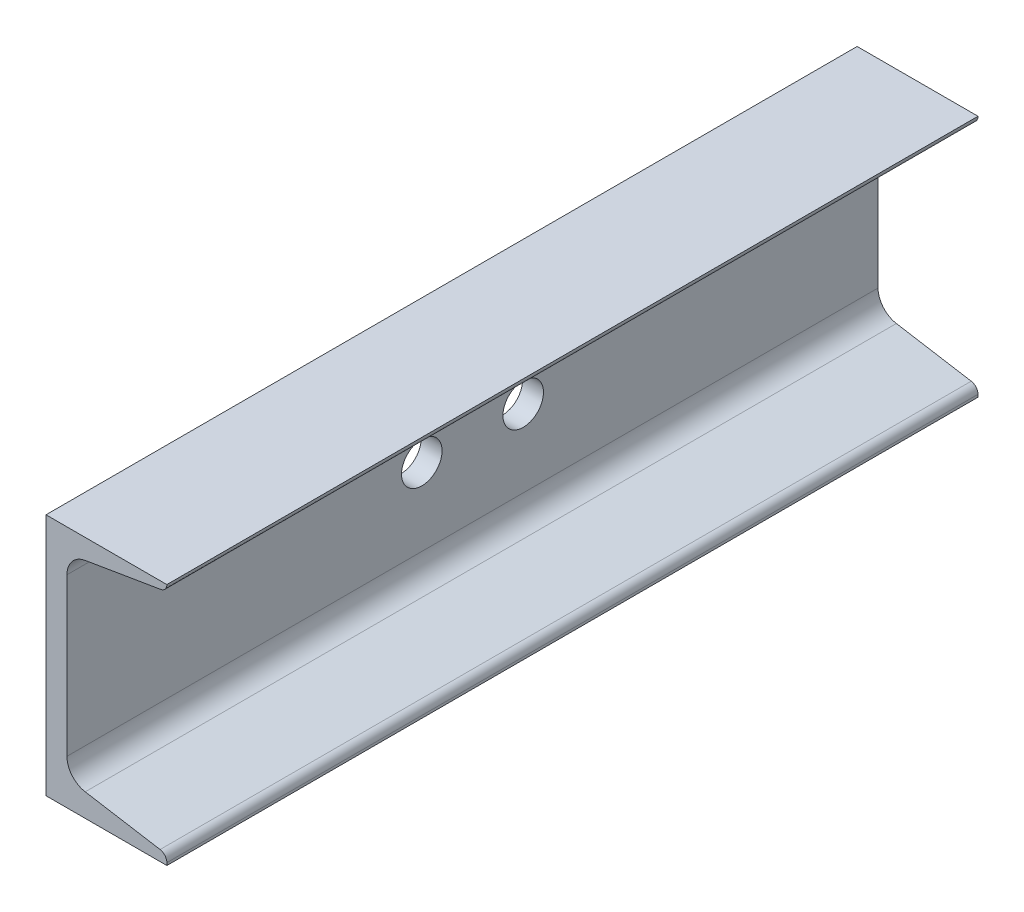
ISO-10303-21;
HEADER;
FILE_DESCRIPTION(('STEP AP214'),'2;1');
FILE_NAME('part.step','',(''),(''),'','','');
FILE_SCHEMA(('AUTOMOTIVE_DESIGN { 1 0 10303 214 1 1 1 1 }'));
ENDSEC;
DATA;
#1=APPLICATION_CONTEXT('core data for automotive mechanical design processes');
#2=APPLICATION_PROTOCOL_DEFINITION('international standard','automotive_design',2000,#1);
#3=PRODUCT_CONTEXT('',#1,'mechanical');
#4=PRODUCT('Part','Part','',(#3));
#5=PRODUCT_RELATED_PRODUCT_CATEGORY('part','',(#4));
#6=PRODUCT_DEFINITION_FORMATION('','',#4);
#7=PRODUCT_DEFINITION_CONTEXT('part definition',#1,'design');
#8=PRODUCT_DEFINITION('design','',#6,#7);
#9=PRODUCT_DEFINITION_SHAPE('','',#8);
#10=(LENGTH_UNIT() NAMED_UNIT(*) SI_UNIT(.MILLI.,.METRE.));
#11=(NAMED_UNIT(*) PLANE_ANGLE_UNIT() SI_UNIT($,.RADIAN.));
#12=(NAMED_UNIT(*) SI_UNIT($,.STERADIAN.) SOLID_ANGLE_UNIT());
#13=UNCERTAINTY_MEASURE_WITH_UNIT(LENGTH_MEASURE(1.E-05),#10,'distance_accuracy_value','');
#14=(GEOMETRIC_REPRESENTATION_CONTEXT(3) GLOBAL_UNCERTAINTY_ASSIGNED_CONTEXT((#13)) GLOBAL_UNIT_ASSIGNED_CONTEXT((#10,
#11,#12)) REPRESENTATION_CONTEXT('',''));
#15=CARTESIAN_POINT('',(0.,0.,0.));
#16=DIRECTION('',(0.,0.,1.));
#17=DIRECTION('',(1.,0.,0.));
#18=AXIS2_PLACEMENT_3D('',#15,#16,#17);
#19=CARTESIAN_POINT('',(37.846,-38.1,127.));
#20=DIRECTION('',(-1.,0.,0.));
#21=DIRECTION('',(0.,0.,1.));
#22=AXIS2_PLACEMENT_3D('',#19,#20,#21);
#23=PLANE('',#22);
#24=DIRECTION('',(0.,1.,0.));
#25=VECTOR('',#24,1.);
#26=CARTESIAN_POINT('',(37.846,-38.1,-127.));
#27=LINE('',#26,#25);
#28=CARTESIAN_POINT('',(37.846,-38.1,-127.));
#29=VERTEX_POINT('',#28);
#30=CARTESIAN_POINT('',(37.846,-37.3185419041306,-127.));
#31=VERTEX_POINT('',#30);
#32=EDGE_CURVE('E152',#29,#31,#27,.T.);
#33=ORIENTED_EDGE('',*,*,#32,.T.);
#34=DIRECTION('',(0.,0.,-1.));
#35=VECTOR('',#34,1.);
#36=CARTESIAN_POINT('',(37.846,-37.3185419041306,127.));
#37=LINE('',#36,#35);
#38=CARTESIAN_POINT('',(37.846,-37.3185419041306,127.));
#39=VERTEX_POINT('',#38);
#40=EDGE_CURVE('E11',#39,#31,#37,.T.);
#41=ORIENTED_EDGE('',*,*,#40,.F.);
#42=DIRECTION('',(0.,1.,0.));
#43=VECTOR('',#42,1.);
#44=CARTESIAN_POINT('',(37.846,-38.1,127.));
#45=LINE('',#44,#43);
#46=CARTESIAN_POINT('',(37.846,-38.1,127.));
#47=VERTEX_POINT('',#46);
#48=EDGE_CURVE('E176',#47,#39,#45,.T.);
#49=ORIENTED_EDGE('',*,*,#48,.F.);
#50=DIRECTION('',(0.,0.,-1.));
#51=VECTOR('',#50,1.);
#52=CARTESIAN_POINT('',(37.846,-38.1,127.));
#53=LINE('',#52,#51);
#54=EDGE_CURVE('E148',#47,#29,#53,.T.);
#55=ORIENTED_EDGE('',*,*,#54,.T.);
#56=EDGE_LOOP('',(#33,#41,#49,#55));
#57=FACE_BOUND('',#56,.T.);
#58=ADVANCED_FACE('F32',(#57),#23,.F.);
#59=CARTESIAN_POINT('',(35.306,-37.3185419041306,127.));
#60=DIRECTION('',(0.,0.,-1.));
#61=DIRECTION('',(-1.,0.,0.));
#62=AXIS2_PLACEMENT_3D('',#59,#60,#61);
#63=CYLINDRICAL_SURFACE('',#62,2.54);
#64=CARTESIAN_POINT('',(35.306,-37.3185419041306,-127.));
#65=DIRECTION('',(0.,0.,1.));
#66=DIRECTION('',(-1.,0.,0.));
#67=AXIS2_PLACEMENT_3D('',#64,#65,#66);
#68=CIRCLE('',#67,2.54);
#69=CARTESIAN_POINT('',(35.7252209188861,-34.813376476226,-127.));
#70=VERTEX_POINT('',#69);
#71=EDGE_CURVE('E155',#31,#70,#68,.T.);
#72=ORIENTED_EDGE('',*,*,#71,.T.);
#73=DIRECTION('',(0.,0.,-1.));
#74=VECTOR('',#73,1.);
#75=CARTESIAN_POINT('',(35.7252209188861,-34.813376476226,127.));
#76=LINE('',#75,#74);
#77=CARTESIAN_POINT('',(35.7252209188861,-34.813376476226,127.));
#78=VERTEX_POINT('',#77);
#79=EDGE_CURVE('E40',#78,#70,#76,.T.);
#80=ORIENTED_EDGE('',*,*,#79,.F.);
#81=CARTESIAN_POINT('',(35.306,-37.3185419041306,127.));
#82=DIRECTION('',(0.,0.,1.));
#83=DIRECTION('',(-1.,0.,0.));
#84=AXIS2_PLACEMENT_3D('',#81,#82,#83);
#85=CIRCLE('',#84,2.54);
#86=EDGE_CURVE('E103',#39,#78,#85,.T.);
#87=ORIENTED_EDGE('',*,*,#86,.F.);
#88=ORIENTED_EDGE('',*,*,#40,.T.);
#89=EDGE_LOOP('',(#72,#80,#87,#88));
#90=FACE_BOUND('',#89,.T.);
#91=ADVANCED_FACE('F254',(#90),#63,.T.);
#92=CARTESIAN_POINT('',(12.2793035190076,-30.889875486223,127.));
#93=DIRECTION('',(-0.165047605860671,-0.986285601537232,0.));
#94=DIRECTION('',(0.986285601537233,-0.165047605860671,0.));
#95=AXIS2_PLACEMENT_3D('',#92,#93,#94);
#96=PLANE('',#95);
#97=DIRECTION('',(-0.986285601537232,0.165047605860671,0.));
#98=VECTOR('',#97,1.);
#99=CARTESIAN_POINT('',(12.2793035190076,-30.889875486223,-127.));
#100=LINE('',#99,#98);
#101=CARTESIAN_POINT('',(12.2793035190076,-30.889875486223,-127.));
#102=VERTEX_POINT('',#101);
#103=EDGE_CURVE('E158',#70,#102,#100,.T.);
#104=ORIENTED_EDGE('',*,*,#103,.T.);
#105=DIRECTION('',(0.,0.,-1.));
#106=VECTOR('',#105,1.);
#107=CARTESIAN_POINT('',(12.2793035190076,-30.889875486223,127.));
#108=LINE('',#107,#106);
#109=CARTESIAN_POINT('',(12.2793035190076,-30.889875486223,127.));
#110=VERTEX_POINT('',#109);
#111=EDGE_CURVE('E195',#110,#102,#108,.T.);
#112=ORIENTED_EDGE('',*,*,#111,.F.);
#113=DIRECTION('',(-0.986285601537232,0.165047605860671,0.));
#114=VECTOR('',#113,1.);
#115=CARTESIAN_POINT('',(12.2793035190076,-30.889875486223,127.));
#116=LINE('',#115,#114);
#117=EDGE_CURVE('E203',#78,#110,#116,.T.);
#118=ORIENTED_EDGE('',*,*,#117,.F.);
#119=ORIENTED_EDGE('',*,*,#79,.T.);
#120=EDGE_LOOP('',(#104,#112,#118,#119));
#121=FACE_BOUND('',#120,.T.);
#122=ADVANCED_FACE('F201',(#121),#96,.F.);
#123=CARTESIAN_POINT('',(13.4112,-24.1259288308807,127.));
#124=DIRECTION('',(0.,0.,-1.));
#125=DIRECTION('',(-1.,0.,0.));
#126=AXIS2_PLACEMENT_3D('',#123,#124,#125);
#127=CYLINDRICAL_SURFACE('',#126,6.858);
#128=CARTESIAN_POINT('',(13.4112,-24.1259288308807,-127.));
#129=DIRECTION('',(0.,0.,-1.));
#130=DIRECTION('',(1.,0.,0.));
#131=AXIS2_PLACEMENT_3D('',#128,#129,#130);
#132=CIRCLE('',#131,6.858);
#133=CARTESIAN_POINT('',(6.55320000000001,-24.1259288308806,-127.));
#134=VERTEX_POINT('',#133);
#135=EDGE_CURVE('E160',#102,#134,#132,.T.);
#136=ORIENTED_EDGE('',*,*,#135,.T.);
#137=DIRECTION('',(0.,0.,-1.));
#138=VECTOR('',#137,1.);
#139=CARTESIAN_POINT('',(6.55320000000001,-24.1259288308806,127.));
#140=LINE('',#139,#138);
#141=CARTESIAN_POINT('',(6.55320000000001,-24.1259288308806,127.));
#142=VERTEX_POINT('',#141);
#143=EDGE_CURVE('E192',#142,#134,#140,.T.);
#144=ORIENTED_EDGE('',*,*,#143,.F.);
#145=CARTESIAN_POINT('',(13.4112,-24.1259288308807,127.));
#146=DIRECTION('',(0.,0.,-1.));
#147=DIRECTION('',(1.,0.,0.));
#148=AXIS2_PLACEMENT_3D('',#145,#146,#147);
#149=CIRCLE('',#148,6.858);
#150=EDGE_CURVE('E221',#110,#142,#149,.T.);
#151=ORIENTED_EDGE('',*,*,#150,.F.);
#152=ORIENTED_EDGE('',*,*,#111,.T.);
#153=EDGE_LOOP('',(#136,#144,#151,#152));
#154=FACE_BOUND('',#153,.T.);
#155=ADVANCED_FACE('F212',(#154),#127,.F.);
#156=CARTESIAN_POINT('',(6.5532,25.1016128592281,127.));
#157=DIRECTION('',(-1.,0.,0.));
#158=DIRECTION('',(0.,-1.,0.));
#159=AXIS2_PLACEMENT_3D('',#156,#157,#158);
#160=PLANE('',#159);
#161=CARTESIAN_POINT('',(6.5532,0.,15.875));
#162=DIRECTION('',(-1.,0.,0.));
#163=DIRECTION('',(0.,-1.,0.));
#164=AXIS2_PLACEMENT_3D('',#161,#162,#163);
#165=CIRCLE('',#164,6.35);
#166=CARTESIAN_POINT('',(6.5532,-6.35,15.875));
#167=VERTEX_POINT('',#166);
#168=EDGE_CURVE('E339',#167,#167,#165,.F.);
#169=ORIENTED_EDGE('',*,*,#168,.F.);
#170=EDGE_LOOP('',(#169));
#171=FACE_BOUND('',#170,.T.);
#172=CARTESIAN_POINT('',(6.5532,0.,-15.875));
#173=DIRECTION('',(-1.,0.,0.));
#174=DIRECTION('',(0.,-1.,0.));
#175=AXIS2_PLACEMENT_3D('',#172,#173,#174);
#176=CIRCLE('',#175,6.35);
#177=CARTESIAN_POINT('',(6.5532,-6.35,-15.875));
#178=VERTEX_POINT('',#177);
#179=EDGE_CURVE('E156',#178,#178,#176,.F.);
#180=ORIENTED_EDGE('',*,*,#179,.F.);
#181=EDGE_LOOP('',(#180));
#182=FACE_BOUND('',#181,.T.);
#183=DIRECTION('',(0.,1.,0.));
#184=VECTOR('',#183,1.);
#185=CARTESIAN_POINT('',(6.5532,25.1016128592281,-127.));
#186=LINE('',#185,#184);
#187=CARTESIAN_POINT('',(6.5532,25.1016128592281,-127.));
#188=VERTEX_POINT('',#187);
#189=EDGE_CURVE('E162',#134,#188,#186,.T.);
#190=ORIENTED_EDGE('',*,*,#189,.T.);
#191=DIRECTION('',(0.,0.,-1.));
#192=VECTOR('',#191,1.);
#193=CARTESIAN_POINT('',(6.5532,25.1016128592281,127.));
#194=LINE('',#193,#192);
#195=CARTESIAN_POINT('',(6.5532,25.1016128592281,127.));
#196=VERTEX_POINT('',#195);
#197=EDGE_CURVE('E189',#196,#188,#194,.T.);
#198=ORIENTED_EDGE('',*,*,#197,.F.);
#199=DIRECTION('',(0.,1.,0.));
#200=VECTOR('',#199,1.);
#201=CARTESIAN_POINT('',(6.5532,25.1016128592281,127.));
#202=LINE('',#201,#200);
#203=EDGE_CURVE('E218',#142,#196,#202,.T.);
#204=ORIENTED_EDGE('',*,*,#203,.F.);
#205=ORIENTED_EDGE('',*,*,#143,.T.);
#206=EDGE_LOOP('',(#190,#198,#204,#205));
#207=FACE_BOUND('',#206,.T.);
#208=ADVANCED_FACE('F216',(#171,#182,#207),#160,.F.);
#209=CARTESIAN_POINT('',(13.4112,25.1016128592282,127.));
#210=DIRECTION('',(0.,0.,-1.));
#211=DIRECTION('',(-1.,0.,0.));
#212=AXIS2_PLACEMENT_3D('',#209,#210,#211);
#213=CYLINDRICAL_SURFACE('',#212,6.858);
#214=CARTESIAN_POINT('',(13.4112,25.1016128592282,-127.));
#215=DIRECTION('',(0.,0.,-1.));
#216=DIRECTION('',(1.,0.,0.));
#217=AXIS2_PLACEMENT_3D('',#214,#215,#216);
#218=CIRCLE('',#217,6.858);
#219=CARTESIAN_POINT('',(12.2793035190075,31.8655595145705,-127.));
#220=VERTEX_POINT('',#219);
#221=EDGE_CURVE('E164',#188,#220,#218,.T.);
#222=ORIENTED_EDGE('',*,*,#221,.T.);
#223=DIRECTION('',(0.,0.,-1.));
#224=VECTOR('',#223,1.);
#225=CARTESIAN_POINT('',(12.2793035190075,31.8655595145705,127.));
#226=LINE('',#225,#224);
#227=CARTESIAN_POINT('',(12.2793035190075,31.8655595145705,127.));
#228=VERTEX_POINT('',#227);
#229=EDGE_CURVE('E186',#228,#220,#226,.T.);
#230=ORIENTED_EDGE('',*,*,#229,.F.);
#231=CARTESIAN_POINT('',(13.4112,25.1016128592282,127.));
#232=DIRECTION('',(0.,0.,-1.));
#233=DIRECTION('',(1.,0.,0.));
#234=AXIS2_PLACEMENT_3D('',#231,#232,#233);
#235=CIRCLE('',#234,6.858);
#236=EDGE_CURVE('E220',#196,#228,#235,.T.);
#237=ORIENTED_EDGE('',*,*,#236,.F.);
#238=ORIENTED_EDGE('',*,*,#197,.T.);
#239=EDGE_LOOP('',(#222,#230,#237,#238));
#240=FACE_BOUND('',#239,.T.);
#241=ADVANCED_FACE('F267',(#240),#213,.F.);
#242=CARTESIAN_POINT('',(12.2793035190075,31.8655595145705,127.));
#243=DIRECTION('',(-0.165047605860678,0.986285601537231,0.));
#244=DIRECTION('',(-0.986285601537231,-0.165047605860678,0.));
#245=AXIS2_PLACEMENT_3D('',#242,#243,#244);
#246=PLANE('',#245);
#247=DIRECTION('',(0.986285601537231,0.165047605860678,0.));
#248=VECTOR('',#247,1.);
#249=CARTESIAN_POINT('',(12.2793035190075,31.8655595145705,-127.));
#250=LINE('',#249,#248);
#251=CARTESIAN_POINT('',(35.9372988269975,35.8245501750456,-127.));
#252=VERTEX_POINT('',#251);
#253=EDGE_CURVE('E166',#220,#252,#250,.T.);
#254=ORIENTED_EDGE('',*,*,#253,.T.);
#255=DIRECTION('',(0.,0.,-1.));
#256=VECTOR('',#255,1.);
#257=CARTESIAN_POINT('',(35.9372988269975,35.8245501750456,127.));
#258=LINE('',#257,#256);
#259=CARTESIAN_POINT('',(35.9372988269975,35.8245501750456,127.));
#260=VERTEX_POINT('',#259);
#261=EDGE_CURVE('E183',#260,#252,#258,.T.);
#262=ORIENTED_EDGE('',*,*,#261,.F.);
#263=DIRECTION('',(0.986285601537231,0.165047605860678,0.));
#264=VECTOR('',#263,1.);
#265=CARTESIAN_POINT('',(12.2793035190075,31.8655595145705,127.));
#266=LINE('',#265,#264);
#267=EDGE_CURVE('E223',#228,#260,#266,.T.);
#268=ORIENTED_EDGE('',*,*,#267,.F.);
#269=ORIENTED_EDGE('',*,*,#229,.T.);
#270=EDGE_LOOP('',(#254,#262,#268,#269));
#271=FACE_BOUND('',#270,.T.);
#272=ADVANCED_FACE('F271',(#271),#246,.F.);
#273=CARTESIAN_POINT('',(35.56,38.0791990601597,127.));
#274=DIRECTION('',(0.,0.,-1.));
#275=DIRECTION('',(-1.,0.,0.));
#276=AXIS2_PLACEMENT_3D('',#273,#274,#275);
#277=CYLINDRICAL_SURFACE('',#276,2.286);
#278=CARTESIAN_POINT('',(35.56,38.0791990601597,-127.));
#279=DIRECTION('',(0.,0.,1.));
#280=DIRECTION('',(1.,0.,0.));
#281=AXIS2_PLACEMENT_3D('',#278,#279,#280);
#282=CIRCLE('',#281,2.286);
#283=CARTESIAN_POINT('',(37.846,38.0791990601597,-127.));
#284=VERTEX_POINT('',#283);
#285=EDGE_CURVE('E168',#252,#284,#282,.T.);
#286=ORIENTED_EDGE('',*,*,#285,.T.);
#287=DIRECTION('',(0.,0.,-1.));
#288=VECTOR('',#287,1.);
#289=CARTESIAN_POINT('',(37.846,38.0791990601597,127.));
#290=LINE('',#289,#288);
#291=CARTESIAN_POINT('',(37.846,38.0791990601597,127.));
#292=VERTEX_POINT('',#291);
#293=EDGE_CURVE('E180',#292,#284,#290,.T.);
#294=ORIENTED_EDGE('',*,*,#293,.F.);
#295=CARTESIAN_POINT('',(35.56,38.0791990601597,127.));
#296=DIRECTION('',(0.,0.,1.));
#297=DIRECTION('',(1.,0.,0.));
#298=AXIS2_PLACEMENT_3D('',#295,#296,#297);
#299=CIRCLE('',#298,2.286);
#300=EDGE_CURVE('E229',#260,#292,#299,.T.);
#301=ORIENTED_EDGE('',*,*,#300,.F.);
#302=ORIENTED_EDGE('',*,*,#261,.T.);
#303=EDGE_LOOP('',(#286,#294,#301,#302));
#304=FACE_BOUND('',#303,.T.);
#305=ADVANCED_FACE('F235',(#304),#277,.T.);
#306=CARTESIAN_POINT('',(37.846,38.1,127.));
#307=DIRECTION('',(-1.,0.,0.));
#308=DIRECTION('',(0.,0.,1.));
#309=AXIS2_PLACEMENT_3D('',#306,#307,#308);
#310=PLANE('',#309);
#311=DIRECTION('',(0.,1.,0.));
#312=VECTOR('',#311,1.);
#313=CARTESIAN_POINT('',(37.846,38.1,-127.));
#314=LINE('',#313,#312);
#315=CARTESIAN_POINT('',(37.846,38.1,-127.));
#316=VERTEX_POINT('',#315);
#317=EDGE_CURVE('E171',#284,#316,#314,.T.);
#318=ORIENTED_EDGE('',*,*,#317,.T.);
#319=DIRECTION('',(0.,0.,-1.));
#320=VECTOR('',#319,1.);
#321=CARTESIAN_POINT('',(37.846,38.1,127.));
#322=LINE('',#321,#320);
#323=CARTESIAN_POINT('',(37.846,38.1,127.));
#324=VERTEX_POINT('',#323);
#325=EDGE_CURVE('E143',#324,#316,#322,.T.);
#326=ORIENTED_EDGE('',*,*,#325,.F.);
#327=DIRECTION('',(0.,1.,0.));
#328=VECTOR('',#327,1.);
#329=CARTESIAN_POINT('',(37.846,38.0953738516822,127.));
#330=LINE('',#329,#328);
#331=EDGE_CURVE('E134',#292,#324,#330,.T.);
#332=ORIENTED_EDGE('',*,*,#331,.F.);
#333=ORIENTED_EDGE('',*,*,#293,.T.);
#334=EDGE_LOOP('',(#318,#326,#332,#333));
#335=FACE_BOUND('',#334,.T.);
#336=ADVANCED_FACE('F238',(#335),#310,.F.);
#337=CARTESIAN_POINT('',(0.,38.1,127.));
#338=DIRECTION('',(0.,-1.,0.));
#339=DIRECTION('',(0.,0.,-1.));
#340=AXIS2_PLACEMENT_3D('',#337,#338,#339);
#341=PLANE('',#340);
#342=DIRECTION('',(-1.,0.,0.));
#343=VECTOR('',#342,1.);
#344=CARTESIAN_POINT('',(0.,38.1,-127.));
#345=LINE('',#344,#343);
#346=CARTESIAN_POINT('',(0.,38.1,-127.));
#347=VERTEX_POINT('',#346);
#348=EDGE_CURVE('E142',#316,#347,#345,.T.);
#349=ORIENTED_EDGE('',*,*,#348,.T.);
#350=DIRECTION('',(0.,0.,-1.));
#351=VECTOR('',#350,1.);
#352=CARTESIAN_POINT('',(0.,38.1,127.));
#353=LINE('',#352,#351);
#354=CARTESIAN_POINT('',(0.,38.1,127.));
#355=VERTEX_POINT('',#354);
#356=EDGE_CURVE('E139',#355,#347,#353,.T.);
#357=ORIENTED_EDGE('',*,*,#356,.F.);
#358=DIRECTION('',(-1.,0.,0.));
#359=VECTOR('',#358,1.);
#360=CARTESIAN_POINT('',(0.,38.1,127.));
#361=LINE('',#360,#359);
#362=EDGE_CURVE('E128',#324,#355,#361,.T.);
#363=ORIENTED_EDGE('',*,*,#362,.F.);
#364=ORIENTED_EDGE('',*,*,#325,.T.);
#365=EDGE_LOOP('',(#349,#357,#363,#364));
#366=FACE_BOUND('',#365,.T.);
#367=ADVANCED_FACE('F140',(#366),#341,.F.);
#368=CARTESIAN_POINT('',(0.,-38.1,127.));
#369=DIRECTION('',(1.,0.,0.));
#370=DIRECTION('',(0.,0.,-1.));
#371=AXIS2_PLACEMENT_3D('',#368,#369,#370);
#372=PLANE('',#371);
#373=CARTESIAN_POINT('',(0.,0.,15.875));
#374=DIRECTION('',(-1.,0.,0.));
#375=DIRECTION('',(0.,0.,1.));
#376=AXIS2_PLACEMENT_3D('',#373,#374,#375);
#377=CIRCLE('',#376,6.35);
#378=CARTESIAN_POINT('',(0.,0.,22.225));
#379=VERTEX_POINT('',#378);
#380=EDGE_CURVE('E336',#379,#379,#377,.T.);
#381=ORIENTED_EDGE('',*,*,#380,.F.);
#382=EDGE_LOOP('',(#381));
#383=FACE_BOUND('',#382,.T.);
#384=CARTESIAN_POINT('',(0.,0.,-15.875));
#385=DIRECTION('',(-1.,0.,0.));
#386=DIRECTION('',(0.,0.,1.));
#387=AXIS2_PLACEMENT_3D('',#384,#385,#386);
#388=CIRCLE('',#387,6.35);
#389=CARTESIAN_POINT('',(0.,0.,-9.525));
#390=VERTEX_POINT('',#389);
#391=EDGE_CURVE('E340',#390,#390,#388,.T.);
#392=ORIENTED_EDGE('',*,*,#391,.F.);
#393=EDGE_LOOP('',(#392));
#394=FACE_BOUND('',#393,.T.);
#395=DIRECTION('',(0.,-1.,0.));
#396=VECTOR('',#395,1.);
#397=CARTESIAN_POINT('',(0.,-38.1,-127.));
#398=LINE('',#397,#396);
#399=CARTESIAN_POINT('',(0.,-38.1,-127.));
#400=VERTEX_POINT('',#399);
#401=EDGE_CURVE('E89',#347,#400,#398,.T.);
#402=ORIENTED_EDGE('',*,*,#401,.T.);
#403=DIRECTION('',(0.,0.,-1.));
#404=VECTOR('',#403,1.);
#405=CARTESIAN_POINT('',(0.,-38.1,127.));
#406=LINE('',#405,#404);
#407=CARTESIAN_POINT('',(0.,-38.1,127.));
#408=VERTEX_POINT('',#407);
#409=EDGE_CURVE('E144',#408,#400,#406,.T.);
#410=ORIENTED_EDGE('',*,*,#409,.F.);
#411=DIRECTION('',(0.,-1.,0.));
#412=VECTOR('',#411,1.);
#413=CARTESIAN_POINT('',(0.,-38.1,127.));
#414=LINE('',#413,#412);
#415=EDGE_CURVE('E132',#355,#408,#414,.T.);
#416=ORIENTED_EDGE('',*,*,#415,.F.);
#417=ORIENTED_EDGE('',*,*,#356,.T.);
#418=EDGE_LOOP('',(#402,#410,#416,#417));
#419=FACE_BOUND('',#418,.T.);
#420=ADVANCED_FACE('F146',(#383,#394,#419),#372,.F.);
#421=CARTESIAN_POINT('',(37.846,-38.1,127.));
#422=DIRECTION('',(0.,1.,0.));
#423=DIRECTION('',(-1.,0.,0.));
#424=AXIS2_PLACEMENT_3D('',#421,#422,#423);
#425=PLANE('',#424);
#426=DIRECTION('',(1.,0.,0.));
#427=VECTOR('',#426,1.);
#428=CARTESIAN_POINT('',(37.846,-38.1,-127.));
#429=LINE('',#428,#427);
#430=EDGE_CURVE('E95',#400,#29,#429,.T.);
#431=ORIENTED_EDGE('',*,*,#430,.T.);
#432=ORIENTED_EDGE('',*,*,#54,.F.);
#433=DIRECTION('',(1.,0.,0.));
#434=VECTOR('',#433,1.);
#435=CARTESIAN_POINT('',(37.846,-38.1,127.));
#436=LINE('',#435,#434);
#437=EDGE_CURVE('E48',#408,#47,#436,.T.);
#438=ORIENTED_EDGE('',*,*,#437,.F.);
#439=ORIENTED_EDGE('',*,*,#409,.T.);
#440=EDGE_LOOP('',(#431,#432,#438,#439));
#441=FACE_BOUND('',#440,.T.);
#442=ADVANCED_FACE('F242',(#441),#425,.F.);
#443=CARTESIAN_POINT('',(35.306,-37.3185419041306,127.));
#444=DIRECTION('',(0.,0.,-1.));
#445=DIRECTION('',(-1.,0.,0.));
#446=AXIS2_PLACEMENT_3D('',#443,#444,#445);
#447=PLANE('',#446);
#448=ORIENTED_EDGE('',*,*,#48,.T.);
#449=ORIENTED_EDGE('',*,*,#86,.T.);
#450=ORIENTED_EDGE('',*,*,#117,.T.);
#451=ORIENTED_EDGE('',*,*,#150,.T.);
#452=ORIENTED_EDGE('',*,*,#203,.T.);
#453=ORIENTED_EDGE('',*,*,#236,.T.);
#454=ORIENTED_EDGE('',*,*,#267,.T.);
#455=ORIENTED_EDGE('',*,*,#300,.T.);
#456=ORIENTED_EDGE('',*,*,#331,.T.);
#457=ORIENTED_EDGE('',*,*,#362,.T.);
#458=ORIENTED_EDGE('',*,*,#415,.T.);
#459=ORIENTED_EDGE('',*,*,#437,.T.);
#460=EDGE_LOOP('',(#448,#449,#450,#451,#452,#453,#454,#455,#456,#457,#458,#459));
#461=FACE_BOUND('',#460,.T.);
#462=ADVANCED_FACE('F130',(#461),#447,.F.);
#463=CARTESIAN_POINT('',(35.306,-37.3185419041306,-127.));
#464=DIRECTION('',(0.,0.,-1.));
#465=DIRECTION('',(-1.,0.,0.));
#466=AXIS2_PLACEMENT_3D('',#463,#464,#465);
#467=PLANE('',#466);
#468=ORIENTED_EDGE('',*,*,#32,.F.);
#469=ORIENTED_EDGE('',*,*,#430,.F.);
#470=ORIENTED_EDGE('',*,*,#401,.F.);
#471=ORIENTED_EDGE('',*,*,#348,.F.);
#472=ORIENTED_EDGE('',*,*,#317,.F.);
#473=ORIENTED_EDGE('',*,*,#285,.F.);
#474=ORIENTED_EDGE('',*,*,#253,.F.);
#475=ORIENTED_EDGE('',*,*,#221,.F.);
#476=ORIENTED_EDGE('',*,*,#189,.F.);
#477=ORIENTED_EDGE('',*,*,#135,.F.);
#478=ORIENTED_EDGE('',*,*,#103,.F.);
#479=ORIENTED_EDGE('',*,*,#71,.F.);
#480=EDGE_LOOP('',(#468,#469,#470,#471,#472,#473,#474,#475,#476,#477,#478,#479));
#481=FACE_BOUND('',#480,.T.);
#482=ADVANCED_FACE('F207',(#481),#467,.T.);
#483=CARTESIAN_POINT('',(37.847,0.,-15.875));
#484=DIRECTION('',(-1.,0.,0.));
#485=DIRECTION('',(0.,0.,1.));
#486=AXIS2_PLACEMENT_3D('',#483,#484,#485);
#487=CYLINDRICAL_SURFACE('',#486,6.35);
#488=ORIENTED_EDGE('',*,*,#391,.T.);
#489=EDGE_LOOP('',(#488));
#490=FACE_BOUND('',#489,.T.);
#491=ORIENTED_EDGE('',*,*,#179,.T.);
#492=EDGE_LOOP('',(#491));
#493=FACE_BOUND('',#492,.T.);
#494=ADVANCED_FACE('F299',(#490,#493),#487,.F.);
#495=CARTESIAN_POINT('',(37.847,0.,15.875));
#496=DIRECTION('',(-1.,0.,0.));
#497=DIRECTION('',(0.,0.,1.));
#498=AXIS2_PLACEMENT_3D('',#495,#496,#497);
#499=CYLINDRICAL_SURFACE('',#498,6.35);
#500=ORIENTED_EDGE('',*,*,#380,.T.);
#501=EDGE_LOOP('',(#500));
#502=FACE_BOUND('',#501,.T.);
#503=ORIENTED_EDGE('',*,*,#168,.T.);
#504=EDGE_LOOP('',(#503));
#505=FACE_BOUND('',#504,.T.);
#506=ADVANCED_FACE('F304',(#502,#505),#499,.F.);
#507=CLOSED_SHELL('',(#58,#91,#122,#155,#208,#241,#272,#305,#336,#367,#420,#442,#462,#482,#494,#506));
#508=MANIFOLD_SOLID_BREP('B2',#507);
#509=ADVANCED_BREP_SHAPE_REPRESENTATION('',(#18,#508),#14);
#510=SHAPE_DEFINITION_REPRESENTATION(#9,#509);
ENDSEC;
END-ISO-10303-21;
